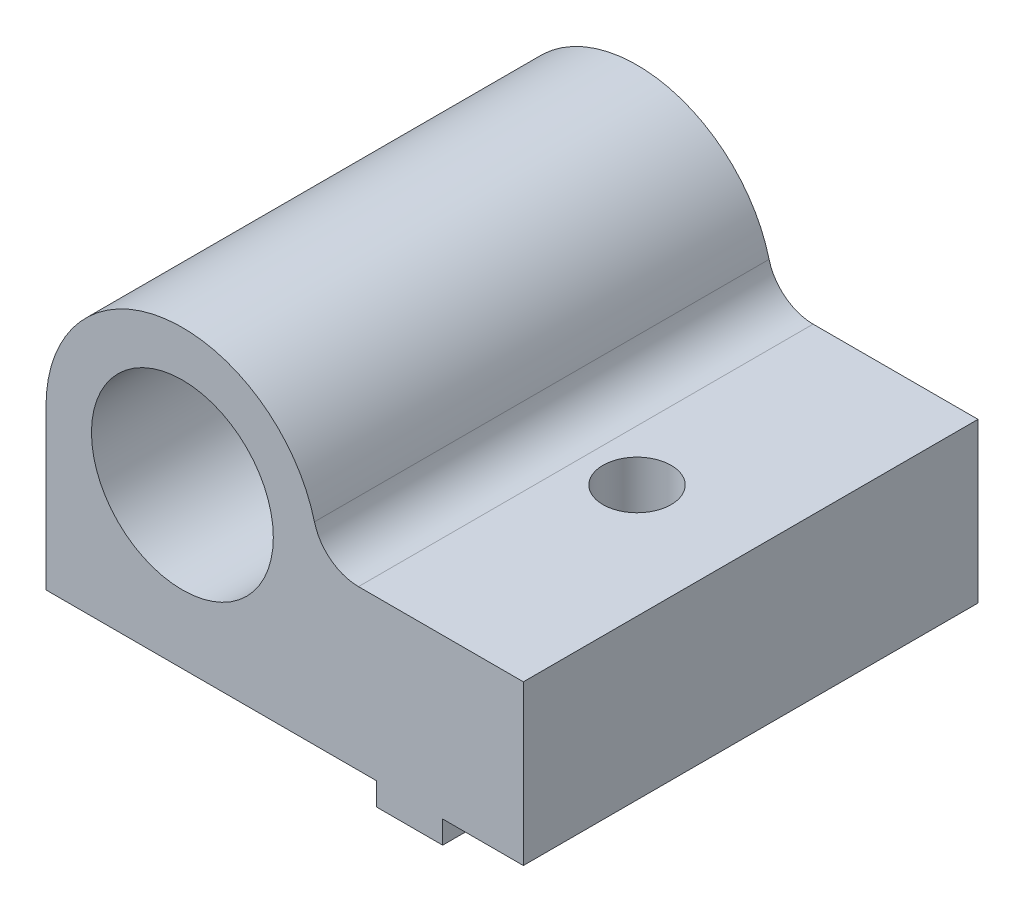
ISO-10303-21;
HEADER;
FILE_DESCRIPTION(('STEP AP214'),'2;1');
FILE_NAME('part.step','',(''),(''),'','','');
FILE_SCHEMA(('AUTOMOTIVE_DESIGN { 1 0 10303 214 1 1 1 1 }'));
ENDSEC;
DATA;
#1=APPLICATION_CONTEXT('core data for automotive mechanical design processes');
#2=APPLICATION_PROTOCOL_DEFINITION('international standard','automotive_design',2000,#1);
#3=PRODUCT_CONTEXT('',#1,'mechanical');
#4=PRODUCT('Part','Part','',(#3));
#5=PRODUCT_RELATED_PRODUCT_CATEGORY('part','',(#4));
#6=PRODUCT_DEFINITION_FORMATION('','',#4);
#7=PRODUCT_DEFINITION_CONTEXT('part definition',#1,'design');
#8=PRODUCT_DEFINITION('design','',#6,#7);
#9=PRODUCT_DEFINITION_SHAPE('','',#8);
#10=(LENGTH_UNIT() NAMED_UNIT(*) SI_UNIT(.MILLI.,.METRE.));
#11=(NAMED_UNIT(*) PLANE_ANGLE_UNIT() SI_UNIT($,.RADIAN.));
#12=(NAMED_UNIT(*) SI_UNIT($,.STERADIAN.) SOLID_ANGLE_UNIT());
#13=UNCERTAINTY_MEASURE_WITH_UNIT(LENGTH_MEASURE(1.E-05),#10,'distance_accuracy_value','');
#14=(GEOMETRIC_REPRESENTATION_CONTEXT(3) GLOBAL_UNCERTAINTY_ASSIGNED_CONTEXT((#13)) GLOBAL_UNIT_ASSIGNED_CONTEXT((#10,
#11,#12)) REPRESENTATION_CONTEXT('',''));
#15=CARTESIAN_POINT('',(0.,0.,0.));
#16=DIRECTION('',(0.,0.,1.));
#17=DIRECTION('',(1.,0.,0.));
#18=AXIS2_PLACEMENT_3D('',#15,#16,#17);
#19=CARTESIAN_POINT('',(8.55,-8.,10.));
#20=DIRECTION('',(1.,0.,0.));
#21=DIRECTION('',(0.,0.,-1.));
#22=AXIS2_PLACEMENT_3D('',#19,#20,#21);
#23=PLANE('',#22);
#24=DIRECTION('',(0.,0.,-1.));
#25=VECTOR('',#24,1.);
#26=CARTESIAN_POINT('',(8.55,-8.,10.));
#27=LINE('',#26,#25);
#28=CARTESIAN_POINT('',(8.55,-8.,-0.384057287393434));
#29=VERTEX_POINT('',#28);
#30=CARTESIAN_POINT('',(8.55000000000001,-8.,-10.));
#31=VERTEX_POINT('',#30);
#32=EDGE_CURVE('E160',#29,#31,#27,.T.);
#33=ORIENTED_EDGE('',*,*,#32,.F.);
#34=DIRECTION('',(0.,1.,0.));
#35=VECTOR('',#34,1.);
#36=CARTESIAN_POINT('',(8.55,-8.,-0.384057287393434));
#37=LINE('',#36,#35);
#38=CARTESIAN_POINT('',(8.55,-7.,-0.384057287393434));
#39=VERTEX_POINT('',#38);
#40=EDGE_CURVE('E166',#29,#39,#37,.T.);
#41=ORIENTED_EDGE('',*,*,#40,.T.);
#42=DIRECTION('',(0.,0.,-1.));
#43=VECTOR('',#42,1.);
#44=CARTESIAN_POINT('',(8.55,-7.,10.));
#45=LINE('',#44,#43);
#46=CARTESIAN_POINT('',(8.55,-7.,-10.));
#47=VERTEX_POINT('',#46);
#48=EDGE_CURVE('E176',#39,#47,#45,.T.);
#49=ORIENTED_EDGE('',*,*,#48,.T.);
#50=DIRECTION('',(0.,1.,0.));
#51=VECTOR('',#50,1.);
#52=CARTESIAN_POINT('',(8.55000000000001,-8.,-10.));
#53=LINE('',#52,#51);
#54=EDGE_CURVE('E186',#31,#47,#53,.T.);
#55=ORIENTED_EDGE('',*,*,#54,.F.);
#56=EDGE_LOOP('',(#33,#41,#49,#55));
#57=FACE_BOUND('',#56,.T.);
#58=ADVANCED_FACE('F33',(#57),#23,.F.);
#59=CARTESIAN_POINT('',(11.45,-8.,10.));
#60=DIRECTION('',(-1.,0.,0.));
#61=DIRECTION('',(0.,0.,1.));
#62=AXIS2_PLACEMENT_3D('',#59,#60,#61);
#63=PLANE('',#62);
#64=DIRECTION('',(0.,0.,1.));
#65=VECTOR('',#64,1.);
#66=CARTESIAN_POINT('',(11.45,-8.,10.));
#67=LINE('',#66,#65);
#68=CARTESIAN_POINT('',(11.45,-8.,0.384057287393447));
#69=VERTEX_POINT('',#68);
#70=CARTESIAN_POINT('',(11.45,-8.,10.));
#71=VERTEX_POINT('',#70);
#72=EDGE_CURVE('E162',#69,#71,#67,.T.);
#73=ORIENTED_EDGE('',*,*,#72,.F.);
#74=DIRECTION('',(0.,1.,0.));
#75=VECTOR('',#74,1.);
#76=CARTESIAN_POINT('',(11.45,-8.,0.384057287393447));
#77=LINE('',#76,#75);
#78=CARTESIAN_POINT('',(11.45,-7.,0.384057287393447));
#79=VERTEX_POINT('',#78);
#80=EDGE_CURVE('E139',#69,#79,#77,.T.);
#81=ORIENTED_EDGE('',*,*,#80,.T.);
#82=DIRECTION('',(0.,0.,1.));
#83=VECTOR('',#82,1.);
#84=CARTESIAN_POINT('',(11.45,-7.,10.));
#85=LINE('',#84,#83);
#86=CARTESIAN_POINT('',(11.45,-7.,10.));
#87=VERTEX_POINT('',#86);
#88=EDGE_CURVE('E175',#79,#87,#85,.T.);
#89=ORIENTED_EDGE('',*,*,#88,.T.);
#90=DIRECTION('',(0.,1.,0.));
#91=VECTOR('',#90,1.);
#92=CARTESIAN_POINT('',(11.45,-8.,10.));
#93=LINE('',#92,#91);
#94=EDGE_CURVE('E180',#71,#87,#93,.T.);
#95=ORIENTED_EDGE('',*,*,#94,.F.);
#96=EDGE_LOOP('',(#73,#81,#89,#95));
#97=FACE_BOUND('',#96,.T.);
#98=ADVANCED_FACE('F266',(#97),#63,.F.);
#99=CARTESIAN_POINT('',(0.,-8.,0.));
#100=DIRECTION('',(0.,-1.,0.));
#101=DIRECTION('',(0.,0.,-1.));
#102=AXIS2_PLACEMENT_3D('',#99,#100,#101);
#103=PLANE('',#102);
#104=CARTESIAN_POINT('',(10.,-8.,0.));
#105=DIRECTION('',(0.,1.,0.));
#106=DIRECTION('',(-1.,0.,0.));
#107=AXIS2_PLACEMENT_3D('',#104,#105,#106);
#108=CIRCLE('',#107,1.5);
#109=CARTESIAN_POINT('',(8.55,-8.,0.384057287393433));
#110=VERTEX_POINT('',#109);
#111=EDGE_CURVE('E133',#110,#69,#108,.T.);
#112=ORIENTED_EDGE('',*,*,#111,.T.);
#113=ORIENTED_EDGE('',*,*,#72,.T.);
#114=DIRECTION('',(-1.,0.,0.));
#115=VECTOR('',#114,1.);
#116=CARTESIAN_POINT('',(8.55,-8.,10.));
#117=LINE('',#116,#115);
#118=CARTESIAN_POINT('',(8.55,-8.,10.));
#119=VERTEX_POINT('',#118);
#120=EDGE_CURVE('E157',#71,#119,#117,.T.);
#121=ORIENTED_EDGE('',*,*,#120,.T.);
#122=EDGE_CURVE('E151',#119,#110,#27,.T.);
#123=ORIENTED_EDGE('',*,*,#122,.T.);
#124=EDGE_LOOP('',(#112,#113,#121,#123));
#125=FACE_BOUND('',#124,.T.);
#126=ADVANCED_FACE('F155',(#125),#103,.T.);
#127=CARTESIAN_POINT('',(-6.,-7.,10.));
#128=DIRECTION('',(0.,1.,0.));
#129=DIRECTION('',(0.,0.,1.));
#130=AXIS2_PLACEMENT_3D('',#127,#128,#129);
#131=PLANE('',#130);
#132=ORIENTED_EDGE('',*,*,#48,.F.);
#133=CARTESIAN_POINT('',(10.,-7.,0.));
#134=DIRECTION('',(0.,1.,0.));
#135=DIRECTION('',(0.,0.,1.));
#136=AXIS2_PLACEMENT_3D('',#133,#134,#135);
#137=CIRCLE('',#136,1.5);
#138=CARTESIAN_POINT('',(8.55,-7.,0.384057287393433));
#139=VERTEX_POINT('',#138);
#140=EDGE_CURVE('E153',#39,#139,#137,.T.);
#141=ORIENTED_EDGE('',*,*,#140,.T.);
#142=CARTESIAN_POINT('',(8.55,-7.,10.));
#143=VERTEX_POINT('',#142);
#144=EDGE_CURVE('E152',#143,#139,#45,.T.);
#145=ORIENTED_EDGE('',*,*,#144,.F.);
#146=DIRECTION('',(1.,0.,0.));
#147=VECTOR('',#146,1.);
#148=CARTESIAN_POINT('',(-6.,-7.,10.));
#149=LINE('',#148,#147);
#150=CARTESIAN_POINT('',(-6.,-7.,10.));
#151=VERTEX_POINT('',#150);
#152=EDGE_CURVE('E204',#151,#143,#149,.T.);
#153=ORIENTED_EDGE('',*,*,#152,.F.);
#154=DIRECTION('',(0.,0.,-1.));
#155=VECTOR('',#154,1.);
#156=CARTESIAN_POINT('',(-6.,-7.,10.));
#157=LINE('',#156,#155);
#158=CARTESIAN_POINT('',(-6.,-7.,-10.));
#159=VERTEX_POINT('',#158);
#160=EDGE_CURVE('E225',#151,#159,#157,.T.);
#161=ORIENTED_EDGE('',*,*,#160,.T.);
#162=DIRECTION('',(1.,0.,0.));
#163=VECTOR('',#162,1.);
#164=CARTESIAN_POINT('',(-6.,-7.,-10.));
#165=LINE('',#164,#163);
#166=EDGE_CURVE('E216',#159,#47,#165,.T.);
#167=ORIENTED_EDGE('',*,*,#166,.T.);
#168=EDGE_LOOP('',(#132,#141,#145,#153,#161,#167));
#169=FACE_BOUND('',#168,.T.);
#170=ADVANCED_FACE('F254',(#169),#131,.F.);
#171=ORIENTED_EDGE('',*,*,#88,.F.);
#172=CARTESIAN_POINT('',(10.,-7.,0.));
#173=DIRECTION('',(0.,1.,0.));
#174=DIRECTION('',(0.,0.,1.));
#175=AXIS2_PLACEMENT_3D('',#172,#173,#174);
#176=CIRCLE('',#175,1.5);
#177=CARTESIAN_POINT('',(11.45,-7.,-0.384057287393447));
#178=VERTEX_POINT('',#177);
#179=EDGE_CURVE('E320',#79,#178,#176,.T.);
#180=ORIENTED_EDGE('',*,*,#179,.T.);
#181=CARTESIAN_POINT('',(11.45,-7.,-10.));
#182=VERTEX_POINT('',#181);
#183=EDGE_CURVE('E164',#182,#178,#85,.T.);
#184=ORIENTED_EDGE('',*,*,#183,.F.);
#185=CARTESIAN_POINT('',(15.,-7.,-10.));
#186=VERTEX_POINT('',#185);
#187=EDGE_CURVE('E215',#182,#186,#165,.T.);
#188=ORIENTED_EDGE('',*,*,#187,.T.);
#189=DIRECTION('',(0.,0.,-1.));
#190=VECTOR('',#189,1.);
#191=CARTESIAN_POINT('',(15.,-7.,10.));
#192=LINE('',#191,#190);
#193=CARTESIAN_POINT('',(15.,-7.,10.));
#194=VERTEX_POINT('',#193);
#195=EDGE_CURVE('E222',#194,#186,#192,.T.);
#196=ORIENTED_EDGE('',*,*,#195,.F.);
#197=EDGE_CURVE('E203',#87,#194,#149,.T.);
#198=ORIENTED_EDGE('',*,*,#197,.F.);
#199=EDGE_LOOP('',(#171,#180,#184,#188,#196,#198));
#200=FACE_BOUND('',#199,.T.);
#201=ADVANCED_FACE('F295',(#200),#131,.F.);
#202=CARTESIAN_POINT('',(0.,0.,10.));
#203=DIRECTION('',(0.,0.,-1.));
#204=DIRECTION('',(-1.,0.,0.));
#205=AXIS2_PLACEMENT_3D('',#202,#203,#204);
#206=PLANE('',#205);
#207=DIRECTION('',(-1.,0.,0.));
#208=VECTOR('',#207,1.);
#209=CARTESIAN_POINT('',(15.,0.,10.));
#210=LINE('',#209,#208);
#211=CARTESIAN_POINT('',(15.,0.,10.));
#212=VERTEX_POINT('',#211);
#213=CARTESIAN_POINT('',(7.74596669241483,0.,10.));
#214=VERTEX_POINT('',#213);
#215=EDGE_CURVE('E196',#212,#214,#210,.T.);
#216=ORIENTED_EDGE('',*,*,#215,.T.);
#217=CARTESIAN_POINT('',(7.74596669241483,2.,10.));
#218=DIRECTION('',(0.,0.,-1.));
#219=DIRECTION('',(-1.,0.,0.));
#220=AXIS2_PLACEMENT_3D('',#217,#218,#219);
#221=CIRCLE('',#220,2.);
#222=CARTESIAN_POINT('',(5.80947501931113,1.5,10.));
#223=VERTEX_POINT('',#222);
#224=EDGE_CURVE('E11',#214,#223,#221,.T.);
#225=ORIENTED_EDGE('',*,*,#224,.T.);
#226=CARTESIAN_POINT('',(0.,0.,10.));
#227=DIRECTION('',(0.,0.,1.));
#228=DIRECTION('',(-1.,0.,0.));
#229=AXIS2_PLACEMENT_3D('',#226,#227,#228);
#230=CIRCLE('',#229,6.);
#231=CARTESIAN_POINT('',(-6.,0.,10.));
#232=VERTEX_POINT('',#231);
#233=EDGE_CURVE('E198',#223,#232,#230,.T.);
#234=ORIENTED_EDGE('',*,*,#233,.T.);
#235=DIRECTION('',(0.,-1.,0.));
#236=VECTOR('',#235,1.);
#237=CARTESIAN_POINT('',(-6.,0.,10.));
#238=LINE('',#237,#236);
#239=EDGE_CURVE('E201',#232,#151,#238,.T.);
#240=ORIENTED_EDGE('',*,*,#239,.T.);
#241=ORIENTED_EDGE('',*,*,#152,.T.);
#242=DIRECTION('',(0.,1.,0.));
#243=VECTOR('',#242,1.);
#244=CARTESIAN_POINT('',(8.55,-8.,10.));
#245=LINE('',#244,#243);
#246=EDGE_CURVE('E173',#119,#143,#245,.T.);
#247=ORIENTED_EDGE('',*,*,#246,.F.);
#248=ORIENTED_EDGE('',*,*,#120,.F.);
#249=ORIENTED_EDGE('',*,*,#94,.T.);
#250=ORIENTED_EDGE('',*,*,#197,.T.);
#251=DIRECTION('',(0.,1.,0.));
#252=VECTOR('',#251,1.);
#253=CARTESIAN_POINT('',(15.,-7.,10.));
#254=LINE('',#253,#252);
#255=EDGE_CURVE('E207',#194,#212,#254,.T.);
#256=ORIENTED_EDGE('',*,*,#255,.T.);
#257=EDGE_LOOP('',(#216,#225,#234,#240,#241,#247,#248,#249,#250,#256));
#258=FACE_BOUND('',#257,.T.);
#259=CARTESIAN_POINT('',(0.,0.,10.));
#260=DIRECTION('',(0.,0.,1.));
#261=DIRECTION('',(1.,0.,0.));
#262=AXIS2_PLACEMENT_3D('',#259,#260,#261);
#263=CIRCLE('',#262,4.);
#264=CARTESIAN_POINT('',(4.,0.,10.));
#265=VERTEX_POINT('',#264);
#266=EDGE_CURVE('E190',#265,#265,#263,.T.);
#267=ORIENTED_EDGE('',*,*,#266,.F.);
#268=EDGE_LOOP('',(#267));
#269=FACE_BOUND('',#268,.T.);
#270=ADVANCED_FACE('F256',(#258,#269),#206,.F.);
#271=CARTESIAN_POINT('',(0.,0.,-10.));
#272=DIRECTION('',(0.,0.,-1.));
#273=DIRECTION('',(-1.,0.,0.));
#274=AXIS2_PLACEMENT_3D('',#271,#272,#273);
#275=PLANE('',#274);
#276=DIRECTION('',(-1.,0.,0.));
#277=VECTOR('',#276,1.);
#278=CARTESIAN_POINT('',(15.,0.,-10.));
#279=LINE('',#278,#277);
#280=CARTESIAN_POINT('',(15.,0.,-10.));
#281=VERTEX_POINT('',#280);
#282=CARTESIAN_POINT('',(7.74596669241483,0.,-10.));
#283=VERTEX_POINT('',#282);
#284=EDGE_CURVE('E193',#281,#283,#279,.T.);
#285=ORIENTED_EDGE('',*,*,#284,.F.);
#286=DIRECTION('',(0.,1.,0.));
#287=VECTOR('',#286,1.);
#288=CARTESIAN_POINT('',(15.,-7.,-10.));
#289=LINE('',#288,#287);
#290=EDGE_CURVE('E199',#186,#281,#289,.T.);
#291=ORIENTED_EDGE('',*,*,#290,.F.);
#292=ORIENTED_EDGE('',*,*,#187,.F.);
#293=DIRECTION('',(0.,1.,0.));
#294=VECTOR('',#293,1.);
#295=CARTESIAN_POINT('',(11.45,-8.,-10.));
#296=LINE('',#295,#294);
#297=CARTESIAN_POINT('',(11.45,-8.,-10.));
#298=VERTEX_POINT('',#297);
#299=EDGE_CURVE('E183',#298,#182,#296,.T.);
#300=ORIENTED_EDGE('',*,*,#299,.F.);
#301=DIRECTION('',(1.,0.,0.));
#302=VECTOR('',#301,1.);
#303=CARTESIAN_POINT('',(8.55000000000001,-8.,-10.));
#304=LINE('',#303,#302);
#305=EDGE_CURVE('E159',#31,#298,#304,.T.);
#306=ORIENTED_EDGE('',*,*,#305,.F.);
#307=ORIENTED_EDGE('',*,*,#54,.T.);
#308=ORIENTED_EDGE('',*,*,#166,.F.);
#309=DIRECTION('',(0.,-1.,0.));
#310=VECTOR('',#309,1.);
#311=CARTESIAN_POINT('',(-6.,0.,-10.));
#312=LINE('',#311,#310);
#313=CARTESIAN_POINT('',(-6.,0.,-10.));
#314=VERTEX_POINT('',#313);
#315=EDGE_CURVE('E213',#314,#159,#312,.T.);
#316=ORIENTED_EDGE('',*,*,#315,.F.);
#317=CARTESIAN_POINT('',(0.,0.,-10.));
#318=DIRECTION('',(0.,0.,1.));
#319=DIRECTION('',(-1.,0.,0.));
#320=AXIS2_PLACEMENT_3D('',#317,#318,#319);
#321=CIRCLE('',#320,6.);
#322=CARTESIAN_POINT('',(5.80947501931113,1.5,-10.));
#323=VERTEX_POINT('',#322);
#324=EDGE_CURVE('E211',#323,#314,#321,.T.);
#325=ORIENTED_EDGE('',*,*,#324,.F.);
#326=CARTESIAN_POINT('',(7.74596669241483,2.,-10.));
#327=DIRECTION('',(0.,0.,-1.));
#328=DIRECTION('',(-1.,0.,0.));
#329=AXIS2_PLACEMENT_3D('',#326,#327,#328);
#330=CIRCLE('',#329,2.);
#331=EDGE_CURVE('E41',#323,#283,#330,.F.);
#332=ORIENTED_EDGE('',*,*,#331,.T.);
#333=EDGE_LOOP('',(#285,#291,#292,#300,#306,#307,#308,#316,#325,#332));
#334=FACE_BOUND('',#333,.T.);
#335=CARTESIAN_POINT('',(0.,0.,-10.));
#336=DIRECTION('',(0.,0.,1.));
#337=DIRECTION('',(1.,0.,0.));
#338=AXIS2_PLACEMENT_3D('',#335,#336,#337);
#339=CIRCLE('',#338,4.);
#340=CARTESIAN_POINT('',(4.,0.,-10.));
#341=VERTEX_POINT('',#340);
#342=EDGE_CURVE('E189',#341,#341,#339,.T.);
#343=ORIENTED_EDGE('',*,*,#342,.T.);
#344=EDGE_LOOP('',(#343));
#345=FACE_BOUND('',#344,.T.);
#346=ADVANCED_FACE('F244',(#334,#345),#275,.T.);
#347=CARTESIAN_POINT('',(15.,0.,10.));
#348=DIRECTION('',(0.,-1.,0.));
#349=DIRECTION('',(1.,0.,0.));
#350=AXIS2_PLACEMENT_3D('',#347,#348,#349);
#351=PLANE('',#350);
#352=CARTESIAN_POINT('',(10.,0.,0.));
#353=DIRECTION('',(0.,1.,0.));
#354=DIRECTION('',(-1.,0.,0.));
#355=AXIS2_PLACEMENT_3D('',#352,#353,#354);
#356=CIRCLE('',#355,1.5);
#357=CARTESIAN_POINT('',(8.5,0.,0.));
#358=VERTEX_POINT('',#357);
#359=EDGE_CURVE('E144',#358,#358,#356,.T.);
#360=ORIENTED_EDGE('',*,*,#359,.F.);
#361=EDGE_LOOP('',(#360));
#362=FACE_BOUND('',#361,.T.);
#363=ORIENTED_EDGE('',*,*,#284,.T.);
#364=DIRECTION('',(0.,0.,1.));
#365=VECTOR('',#364,1.);
#366=CARTESIAN_POINT('',(7.74596669241483,0.,10.));
#367=LINE('',#366,#365);
#368=EDGE_CURVE('E48',#283,#214,#367,.T.);
#369=ORIENTED_EDGE('',*,*,#368,.T.);
#370=ORIENTED_EDGE('',*,*,#215,.F.);
#371=DIRECTION('',(0.,0.,-1.));
#372=VECTOR('',#371,1.);
#373=CARTESIAN_POINT('',(15.,0.,10.));
#374=LINE('',#373,#372);
#375=EDGE_CURVE('E209',#212,#281,#374,.T.);
#376=ORIENTED_EDGE('',*,*,#375,.T.);
#377=EDGE_LOOP('',(#363,#369,#370,#376));
#378=FACE_BOUND('',#377,.T.);
#379=ADVANCED_FACE('F297',(#362,#378),#351,.F.);
#380=CARTESIAN_POINT('',(0.,0.,10.));
#381=DIRECTION('',(0.,0.,-1.));
#382=DIRECTION('',(-1.,0.,0.));
#383=AXIS2_PLACEMENT_3D('',#380,#381,#382);
#384=CYLINDRICAL_SURFACE('',#383,6.);
#385=ORIENTED_EDGE('',*,*,#233,.F.);
#386=DIRECTION('',(0.,0.,-1.));
#387=VECTOR('',#386,1.);
#388=CARTESIAN_POINT('',(5.80947501931113,1.5,10.));
#389=LINE('',#388,#387);
#390=EDGE_CURVE('E233',#223,#323,#389,.T.);
#391=ORIENTED_EDGE('',*,*,#390,.T.);
#392=ORIENTED_EDGE('',*,*,#324,.T.);
#393=DIRECTION('',(0.,0.,-1.));
#394=VECTOR('',#393,1.);
#395=CARTESIAN_POINT('',(-6.,0.,10.));
#396=LINE('',#395,#394);
#397=EDGE_CURVE('E228',#232,#314,#396,.T.);
#398=ORIENTED_EDGE('',*,*,#397,.F.);
#399=EDGE_LOOP('',(#385,#391,#392,#398));
#400=FACE_BOUND('',#399,.T.);
#401=ADVANCED_FACE('F239',(#400),#384,.T.);
#402=CARTESIAN_POINT('',(-6.,0.,10.));
#403=DIRECTION('',(1.,0.,0.));
#404=DIRECTION('',(0.,1.,0.));
#405=AXIS2_PLACEMENT_3D('',#402,#403,#404);
#406=PLANE('',#405);
#407=ORIENTED_EDGE('',*,*,#315,.T.);
#408=ORIENTED_EDGE('',*,*,#160,.F.);
#409=ORIENTED_EDGE('',*,*,#239,.F.);
#410=ORIENTED_EDGE('',*,*,#397,.T.);
#411=EDGE_LOOP('',(#407,#408,#409,#410));
#412=FACE_BOUND('',#411,.T.);
#413=ADVANCED_FACE('F249',(#412),#406,.F.);
#414=CARTESIAN_POINT('',(15.,-7.,10.));
#415=DIRECTION('',(-1.,0.,0.));
#416=DIRECTION('',(0.,0.,1.));
#417=AXIS2_PLACEMENT_3D('',#414,#415,#416);
#418=PLANE('',#417);
#419=ORIENTED_EDGE('',*,*,#290,.T.);
#420=ORIENTED_EDGE('',*,*,#375,.F.);
#421=ORIENTED_EDGE('',*,*,#255,.F.);
#422=ORIENTED_EDGE('',*,*,#195,.T.);
#423=EDGE_LOOP('',(#419,#420,#421,#422));
#424=FACE_BOUND('',#423,.T.);
#425=ADVANCED_FACE('F284',(#424),#418,.F.);
#426=CARTESIAN_POINT('',(0.,0.,10.));
#427=DIRECTION('',(0.,0.,-1.));
#428=DIRECTION('',(-1.,0.,0.));
#429=AXIS2_PLACEMENT_3D('',#426,#427,#428);
#430=CYLINDRICAL_SURFACE('',#429,4.);
#431=ORIENTED_EDGE('',*,*,#266,.T.);
#432=EDGE_LOOP('',(#431));
#433=FACE_BOUND('',#432,.T.);
#434=ORIENTED_EDGE('',*,*,#342,.F.);
#435=EDGE_LOOP('',(#434));
#436=FACE_BOUND('',#435,.T.);
#437=ADVANCED_FACE('F278',(#433,#436),#430,.F.);
#438=ORIENTED_EDGE('',*,*,#144,.T.);
#439=DIRECTION('',(0.,1.,0.));
#440=VECTOR('',#439,1.);
#441=CARTESIAN_POINT('',(8.55,-8.,0.384057287393433));
#442=LINE('',#441,#440);
#443=EDGE_CURVE('E136',#139,#110,#442,.F.);
#444=ORIENTED_EDGE('',*,*,#443,.T.);
#445=ORIENTED_EDGE('',*,*,#122,.F.);
#446=ORIENTED_EDGE('',*,*,#246,.T.);
#447=EDGE_LOOP('',(#438,#444,#445,#446));
#448=FACE_BOUND('',#447,.T.);
#449=ADVANCED_FACE('F149',(#448),#23,.F.);
#450=ORIENTED_EDGE('',*,*,#183,.T.);
#451=DIRECTION('',(0.,1.,0.));
#452=VECTOR('',#451,1.);
#453=CARTESIAN_POINT('',(11.45,-8.,-0.384057287393447));
#454=LINE('',#453,#452);
#455=CARTESIAN_POINT('',(11.45,-8.,-0.384057287393447));
#456=VERTEX_POINT('',#455);
#457=EDGE_CURVE('E143',#178,#456,#454,.F.);
#458=ORIENTED_EDGE('',*,*,#457,.T.);
#459=EDGE_CURVE('E169',#298,#456,#67,.T.);
#460=ORIENTED_EDGE('',*,*,#459,.F.);
#461=ORIENTED_EDGE('',*,*,#299,.T.);
#462=EDGE_LOOP('',(#450,#458,#460,#461));
#463=FACE_BOUND('',#462,.T.);
#464=ADVANCED_FACE('F274',(#463),#63,.F.);
#465=CARTESIAN_POINT('',(10.,-8.,0.));
#466=DIRECTION('',(0.,-1.,0.));
#467=DIRECTION('',(0.,0.,-1.));
#468=AXIS2_PLACEMENT_3D('',#465,#466,#467);
#469=CIRCLE('',#468,1.5);
#470=EDGE_CURVE('E231',#29,#456,#469,.T.);
#471=ORIENTED_EDGE('',*,*,#470,.F.);
#472=ORIENTED_EDGE('',*,*,#32,.T.);
#473=ORIENTED_EDGE('',*,*,#305,.T.);
#474=ORIENTED_EDGE('',*,*,#459,.T.);
#475=EDGE_LOOP('',(#471,#472,#473,#474));
#476=FACE_BOUND('',#475,.T.);
#477=ADVANCED_FACE('F262',(#476),#103,.T.);
#478=CARTESIAN_POINT('',(10.,-8.,0.));
#479=DIRECTION('',(0.,1.,0.));
#480=DIRECTION('',(-1.,0.,0.));
#481=AXIS2_PLACEMENT_3D('',#478,#479,#480);
#482=CYLINDRICAL_SURFACE('',#481,1.5);
#483=ORIENTED_EDGE('',*,*,#359,.T.);
#484=EDGE_LOOP('',(#483));
#485=FACE_BOUND('',#484,.T.);
#486=ORIENTED_EDGE('',*,*,#470,.T.);
#487=ORIENTED_EDGE('',*,*,#457,.F.);
#488=ORIENTED_EDGE('',*,*,#179,.F.);
#489=ORIENTED_EDGE('',*,*,#80,.F.);
#490=ORIENTED_EDGE('',*,*,#111,.F.);
#491=ORIENTED_EDGE('',*,*,#443,.F.);
#492=ORIENTED_EDGE('',*,*,#140,.F.);
#493=ORIENTED_EDGE('',*,*,#40,.F.);
#494=EDGE_LOOP('',(#486,#487,#488,#489,#490,#491,#492,#493));
#495=FACE_BOUND('',#494,.T.);
#496=ADVANCED_FACE('F135',(#485,#495),#482,.F.);
#497=CARTESIAN_POINT('',(7.74596669241483,2.,10.));
#498=DIRECTION('',(0.,0.,-1.));
#499=DIRECTION('',(-1.,0.,0.));
#500=AXIS2_PLACEMENT_3D('',#497,#498,#499);
#501=CYLINDRICAL_SURFACE('',#500,2.);
#502=ORIENTED_EDGE('',*,*,#224,.F.);
#503=ORIENTED_EDGE('',*,*,#368,.F.);
#504=ORIENTED_EDGE('',*,*,#331,.F.);
#505=ORIENTED_EDGE('',*,*,#390,.F.);
#506=EDGE_LOOP('',(#502,#503,#504,#505));
#507=FACE_BOUND('',#506,.T.);
#508=ADVANCED_FACE('F35',(#507),#501,.F.);
#509=CLOSED_SHELL('',(#58,#98,#126,#170,#201,#270,#346,#379,#401,#413,#425,#437,#449,#464,#477,
#496,#508));
#510=MANIFOLD_SOLID_BREP('B2',#509);
#511=ADVANCED_BREP_SHAPE_REPRESENTATION('',(#18,#510),#14);
#512=SHAPE_DEFINITION_REPRESENTATION(#9,#511);
ENDSEC;
END-ISO-10303-21;
